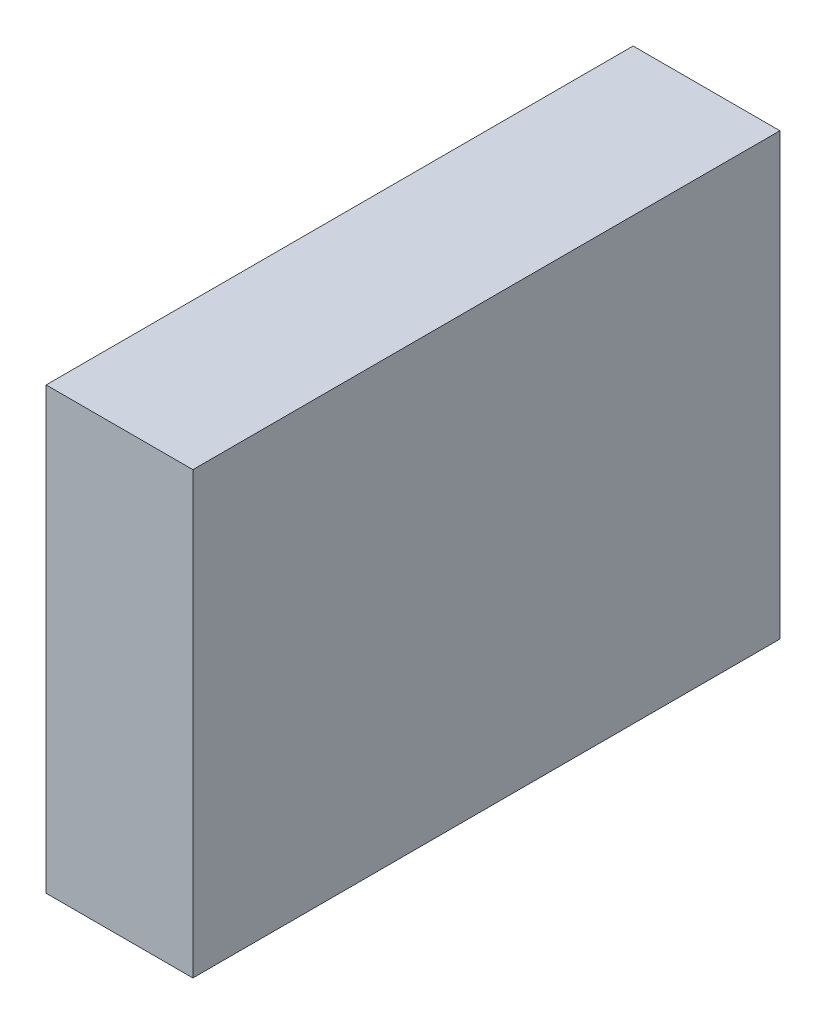
ISO-10303-21;
HEADER;
FILE_DESCRIPTION(('STEP AP214'),'2;1');
FILE_NAME('part.step','',(''),(''),'','','');
FILE_SCHEMA(('AUTOMOTIVE_DESIGN { 1 0 10303 214 1 1 1 1 }'));
ENDSEC;
DATA;
#1=APPLICATION_CONTEXT('core data for automotive mechanical design processes');
#2=APPLICATION_PROTOCOL_DEFINITION('international standard','automotive_design',2000,#1);
#3=PRODUCT_CONTEXT('',#1,'mechanical');
#4=PRODUCT('Part','Part','',(#3));
#5=PRODUCT_RELATED_PRODUCT_CATEGORY('part','',(#4));
#6=PRODUCT_DEFINITION_FORMATION('','',#4);
#7=PRODUCT_DEFINITION_CONTEXT('part definition',#1,'design');
#8=PRODUCT_DEFINITION('design','',#6,#7);
#9=PRODUCT_DEFINITION_SHAPE('','',#8);
#10=(LENGTH_UNIT() NAMED_UNIT(*) SI_UNIT(.MILLI.,.METRE.));
#11=(NAMED_UNIT(*) PLANE_ANGLE_UNIT() SI_UNIT($,.RADIAN.));
#12=(NAMED_UNIT(*) SI_UNIT($,.STERADIAN.) SOLID_ANGLE_UNIT());
#13=UNCERTAINTY_MEASURE_WITH_UNIT(LENGTH_MEASURE(1.E-05),#10,'distance_accuracy_value','');
#14=(GEOMETRIC_REPRESENTATION_CONTEXT(3) GLOBAL_UNCERTAINTY_ASSIGNED_CONTEXT((#13)) GLOBAL_UNIT_ASSIGNED_CONTEXT((#10,
#11,#12)) REPRESENTATION_CONTEXT('',''));
#15=CARTESIAN_POINT('',(0.,0.,0.));
#16=DIRECTION('',(0.,0.,1.));
#17=DIRECTION('',(1.,0.,0.));
#18=AXIS2_PLACEMENT_3D('',#15,#16,#17);
#19=CARTESIAN_POINT('',(-0.04999990000002,0.1499997,0.));
#20=DIRECTION('',(1.,0.,0.));
#21=DIRECTION('',(0.,0.,-1.));
#22=AXIS2_PLACEMENT_3D('',#19,#20,#21);
#23=PLANE('',#22);
#24=DIRECTION('',(0.,0.,1.));
#25=VECTOR('',#24,1.);
#26=CARTESIAN_POINT('',(-0.04999990000002,-0.1499997,0.));
#27=LINE('',#26,#25);
#28=CARTESIAN_POINT('',(-0.04999990000002,-0.1499997,0.));
#29=VERTEX_POINT('',#28);
#30=CARTESIAN_POINT('',(-0.04999990000002,-0.1499997,0.3999992));
#31=VERTEX_POINT('',#30);
#32=EDGE_CURVE('E20',#29,#31,#27,.T.);
#33=ORIENTED_EDGE('',*,*,#32,.T.);
#34=DIRECTION('',(0.,1.,0.));
#35=VECTOR('',#34,1.);
#36=CARTESIAN_POINT('',(-0.04999990000002,-0.1499997,0.3999992));
#37=LINE('',#36,#35);
#38=CARTESIAN_POINT('',(-0.04999990000002,0.1499997,0.3999992));
#39=VERTEX_POINT('',#38);
#40=EDGE_CURVE('E55',#31,#39,#37,.T.);
#41=ORIENTED_EDGE('',*,*,#40,.T.);
#42=DIRECTION('',(0.,0.,-1.));
#43=VECTOR('',#42,1.);
#44=CARTESIAN_POINT('',(-0.04999990000002,0.1499997,0.));
#45=LINE('',#44,#43);
#46=CARTESIAN_POINT('',(-0.04999990000002,0.1499997,0.));
#47=VERTEX_POINT('',#46);
#48=EDGE_CURVE('E76',#39,#47,#45,.T.);
#49=ORIENTED_EDGE('',*,*,#48,.T.);
#50=DIRECTION('',(0.,1.,0.));
#51=VECTOR('',#50,1.);
#52=CARTESIAN_POINT('',(-0.04999990000002,-0.1499997,0.));
#53=LINE('',#52,#51);
#54=EDGE_CURVE('E58',#29,#47,#53,.T.);
#55=ORIENTED_EDGE('',*,*,#54,.F.);
#56=EDGE_LOOP('',(#33,#41,#49,#55));
#57=FACE_BOUND('',#56,.T.);
#58=ADVANCED_FACE('F17',(#57),#23,.F.);
#59=CARTESIAN_POINT('',(-0.04999990000002,-0.1499997,0.));
#60=DIRECTION('',(0.,1.,0.));
#61=DIRECTION('',(0.,0.,1.));
#62=AXIS2_PLACEMENT_3D('',#59,#60,#61);
#63=PLANE('',#62);
#64=DIRECTION('',(0.,0.,1.));
#65=VECTOR('',#64,1.);
#66=CARTESIAN_POINT('',(0.04999989999999,-0.1499997,0.));
#67=LINE('',#66,#65);
#68=CARTESIAN_POINT('',(0.04999989999999,-0.1499997,0.));
#69=VERTEX_POINT('',#68);
#70=CARTESIAN_POINT('',(0.04999989999999,-0.1499997,0.3999992));
#71=VERTEX_POINT('',#70);
#72=EDGE_CURVE('E73',#69,#71,#67,.T.);
#73=ORIENTED_EDGE('',*,*,#72,.T.);
#74=DIRECTION('',(-1.,0.,0.));
#75=VECTOR('',#74,1.);
#76=CARTESIAN_POINT('',(0.04999989999999,-0.1499997,0.3999992));
#77=LINE('',#76,#75);
#78=EDGE_CURVE('E63',#71,#31,#77,.T.);
#79=ORIENTED_EDGE('',*,*,#78,.T.);
#80=ORIENTED_EDGE('',*,*,#32,.F.);
#81=DIRECTION('',(-1.,0.,0.));
#82=VECTOR('',#81,1.);
#83=CARTESIAN_POINT('',(0.04999989999999,-0.1499997,0.));
#84=LINE('',#83,#82);
#85=EDGE_CURVE('E78',#69,#29,#84,.T.);
#86=ORIENTED_EDGE('',*,*,#85,.F.);
#87=EDGE_LOOP('',(#73,#79,#80,#86));
#88=FACE_BOUND('',#87,.T.);
#89=ADVANCED_FACE('F72',(#88),#63,.F.);
#90=CARTESIAN_POINT('',(0.04999989999999,-0.1499997,0.3999992));
#91=DIRECTION('',(0.,0.,-1.));
#92=DIRECTION('',(-1.,0.,0.));
#93=AXIS2_PLACEMENT_3D('',#90,#91,#92);
#94=PLANE('',#93);
#95=DIRECTION('',(1.,0.,0.));
#96=VECTOR('',#95,1.);
#97=CARTESIAN_POINT('',(0.04999989999999,0.1499997,0.3999992));
#98=LINE('',#97,#96);
#99=CARTESIAN_POINT('',(0.04999989999999,0.1499997,0.3999992));
#100=VERTEX_POINT('',#99);
#101=EDGE_CURVE('E69',#100,#39,#98,.F.);
#102=ORIENTED_EDGE('',*,*,#101,.T.);
#103=ORIENTED_EDGE('',*,*,#40,.F.);
#104=ORIENTED_EDGE('',*,*,#78,.F.);
#105=DIRECTION('',(0.,1.,0.));
#106=VECTOR('',#105,1.);
#107=CARTESIAN_POINT('',(0.04999989999999,-0.1499997,0.3999992));
#108=LINE('',#107,#106);
#109=EDGE_CURVE('E83',#71,#100,#108,.T.);
#110=ORIENTED_EDGE('',*,*,#109,.T.);
#111=EDGE_LOOP('',(#102,#103,#104,#110));
#112=FACE_BOUND('',#111,.T.);
#113=ADVANCED_FACE('F66',(#112),#94,.F.);
#114=CARTESIAN_POINT('',(0.04999989999999,0.1499997,0.));
#115=DIRECTION('',(0.,-1.,0.));
#116=DIRECTION('',(0.,0.,-1.));
#117=AXIS2_PLACEMENT_3D('',#114,#115,#116);
#118=PLANE('',#117);
#119=ORIENTED_EDGE('',*,*,#48,.F.);
#120=ORIENTED_EDGE('',*,*,#101,.F.);
#121=DIRECTION('',(0.,0.,1.));
#122=VECTOR('',#121,1.);
#123=CARTESIAN_POINT('',(0.04999989999999,0.1499997,0.));
#124=LINE('',#123,#122);
#125=CARTESIAN_POINT('',(0.04999989999999,0.1499997,0.));
#126=VERTEX_POINT('',#125);
#127=EDGE_CURVE('E26',#100,#126,#124,.F.);
#128=ORIENTED_EDGE('',*,*,#127,.T.);
#129=DIRECTION('',(-1.,0.,0.));
#130=VECTOR('',#129,1.);
#131=CARTESIAN_POINT('',(0.04999989999999,0.1499997,0.));
#132=LINE('',#131,#130);
#133=EDGE_CURVE('E34',#47,#126,#132,.F.);
#134=ORIENTED_EDGE('',*,*,#133,.F.);
#135=EDGE_LOOP('',(#119,#120,#128,#134));
#136=FACE_BOUND('',#135,.T.);
#137=ADVANCED_FACE('F88',(#136),#118,.F.);
#138=CARTESIAN_POINT('',(0.04999989999999,-0.1499997,0.));
#139=DIRECTION('',(0.,0.,-1.));
#140=DIRECTION('',(-1.,0.,0.));
#141=AXIS2_PLACEMENT_3D('',#138,#139,#140);
#142=PLANE('',#141);
#143=ORIENTED_EDGE('',*,*,#133,.T.);
#144=DIRECTION('',(0.,1.,0.));
#145=VECTOR('',#144,1.);
#146=CARTESIAN_POINT('',(0.04999989999999,-0.1499997,0.));
#147=LINE('',#146,#145);
#148=EDGE_CURVE('E11',#126,#69,#147,.F.);
#149=ORIENTED_EDGE('',*,*,#148,.T.);
#150=ORIENTED_EDGE('',*,*,#85,.T.);
#151=ORIENTED_EDGE('',*,*,#54,.T.);
#152=EDGE_LOOP('',(#143,#149,#150,#151));
#153=FACE_BOUND('',#152,.T.);
#154=ADVANCED_FACE('F91',(#153),#142,.T.);
#155=CARTESIAN_POINT('',(0.04999989999999,-0.1499997,0.));
#156=DIRECTION('',(-1.,0.,0.));
#157=DIRECTION('',(0.,0.,1.));
#158=AXIS2_PLACEMENT_3D('',#155,#156,#157);
#159=PLANE('',#158);
#160=ORIENTED_EDGE('',*,*,#127,.F.);
#161=ORIENTED_EDGE('',*,*,#109,.F.);
#162=ORIENTED_EDGE('',*,*,#72,.F.);
#163=ORIENTED_EDGE('',*,*,#148,.F.);
#164=EDGE_LOOP('',(#160,#161,#162,#163));
#165=FACE_BOUND('',#164,.T.);
#166=ADVANCED_FACE('F90',(#165),#159,.F.);
#167=CLOSED_SHELL('',(#58,#89,#113,#137,#154,#166));
#168=MANIFOLD_SOLID_BREP('B1',#167);
#169=ADVANCED_BREP_SHAPE_REPRESENTATION('',(#18,#168),#14);
#170=SHAPE_DEFINITION_REPRESENTATION(#9,#169);
ENDSEC;
END-ISO-10303-21;
